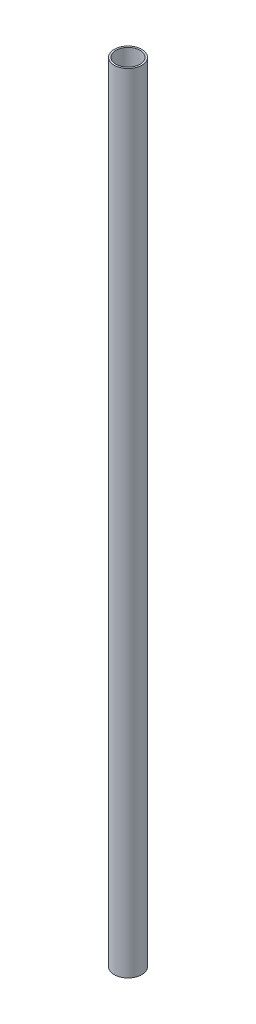
ISO-10303-21;
HEADER;
FILE_DESCRIPTION(('STEP AP214'),'2;1');
FILE_NAME('part.step','',(''),(''),'','','');
FILE_SCHEMA(('AUTOMOTIVE_DESIGN { 1 0 10303 214 1 1 1 1 }'));
ENDSEC;
DATA;
#1=APPLICATION_CONTEXT('core data for automotive mechanical design processes');
#2=APPLICATION_PROTOCOL_DEFINITION('international standard','automotive_design',2000,#1);
#3=PRODUCT_CONTEXT('',#1,'mechanical');
#4=PRODUCT('Part','Part','',(#3));
#5=PRODUCT_RELATED_PRODUCT_CATEGORY('part','',(#4));
#6=PRODUCT_DEFINITION_FORMATION('','',#4);
#7=PRODUCT_DEFINITION_CONTEXT('part definition',#1,'design');
#8=PRODUCT_DEFINITION('design','',#6,#7);
#9=PRODUCT_DEFINITION_SHAPE('','',#8);
#10=(LENGTH_UNIT() NAMED_UNIT(*) SI_UNIT(.MILLI.,.METRE.));
#11=(NAMED_UNIT(*) PLANE_ANGLE_UNIT() SI_UNIT($,.RADIAN.));
#12=(NAMED_UNIT(*) SI_UNIT($,.STERADIAN.) SOLID_ANGLE_UNIT());
#13=UNCERTAINTY_MEASURE_WITH_UNIT(LENGTH_MEASURE(1.E-05),#10,'distance_accuracy_value','');
#14=(GEOMETRIC_REPRESENTATION_CONTEXT(3) GLOBAL_UNCERTAINTY_ASSIGNED_CONTEXT((#13)) GLOBAL_UNIT_ASSIGNED_CONTEXT((#10,
#11,#12)) REPRESENTATION_CONTEXT('',''));
#15=CARTESIAN_POINT('',(0.,0.,0.));
#16=DIRECTION('',(0.,0.,1.));
#17=DIRECTION('',(1.,0.,0.));
#18=AXIS2_PLACEMENT_3D('',#15,#16,#17);
#19=CARTESIAN_POINT('',(0.,21.6725621621133,0.));
#20=DIRECTION('',(0.,1.,0.));
#21=DIRECTION('',(0.,0.,1.));
#22=AXIS2_PLACEMENT_3D('',#19,#20,#21);
#23=PLANE('',#22);
#24=CARTESIAN_POINT('',(0.,21.6725621621133,0.));
#25=DIRECTION('',(0.,1.,0.));
#26=DIRECTION('',(0.,0.,1.));
#27=AXIS2_PLACEMENT_3D('',#24,#25,#26);
#28=CIRCLE('',#27,9.52500000000004);
#29=CARTESIAN_POINT('',(0.,21.6725621621133,9.52500000000004));
#30=VERTEX_POINT('',#29);
#31=EDGE_CURVE('E10',#30,#30,#28,.T.);
#32=ORIENTED_EDGE('',*,*,#31,.T.);
#33=EDGE_LOOP('',(#32));
#34=FACE_BOUND('',#33,.T.);
#35=CARTESIAN_POINT('',(0.,21.6725621621133,0.));
#36=DIRECTION('',(0.,1.,0.));
#37=DIRECTION('',(0.,0.,1.));
#38=AXIS2_PLACEMENT_3D('',#35,#36,#37);
#39=CIRCLE('',#38,8.32500000000004);
#40=CARTESIAN_POINT('',(0.,21.6725621621133,8.32500000000004));
#41=VERTEX_POINT('',#40);
#42=EDGE_CURVE('E49',#41,#41,#39,.T.);
#43=ORIENTED_EDGE('',*,*,#42,.F.);
#44=EDGE_LOOP('',(#43));
#45=FACE_BOUND('',#44,.T.);
#46=ADVANCED_FACE('F38',(#34,#45),#23,.T.);
#47=CARTESIAN_POINT('',(0.,-521.327437837887,0.));
#48=DIRECTION('',(0.,1.,0.));
#49=DIRECTION('',(0.,0.,1.));
#50=AXIS2_PLACEMENT_3D('',#47,#48,#49);
#51=PLANE('',#50);
#52=CARTESIAN_POINT('',(0.,-521.327437837887,0.));
#53=DIRECTION('',(0.,1.,0.));
#54=DIRECTION('',(0.,0.,1.));
#55=AXIS2_PLACEMENT_3D('',#52,#53,#54);
#56=CIRCLE('',#55,9.52500000000004);
#57=CARTESIAN_POINT('',(0.,-521.327437837887,9.52500000000004));
#58=VERTEX_POINT('',#57);
#59=EDGE_CURVE('E42',#58,#58,#56,.T.);
#60=ORIENTED_EDGE('',*,*,#59,.F.);
#61=EDGE_LOOP('',(#60));
#62=FACE_BOUND('',#61,.T.);
#63=CARTESIAN_POINT('',(0.,-521.327437837887,0.));
#64=DIRECTION('',(0.,1.,0.));
#65=DIRECTION('',(0.,0.,1.));
#66=AXIS2_PLACEMENT_3D('',#63,#64,#65);
#67=CIRCLE('',#66,8.32500000000004);
#68=CARTESIAN_POINT('',(0.,-521.327437837887,8.32500000000004));
#69=VERTEX_POINT('',#68);
#70=EDGE_CURVE('E51',#69,#69,#67,.T.);
#71=ORIENTED_EDGE('',*,*,#70,.T.);
#72=EDGE_LOOP('',(#71));
#73=FACE_BOUND('',#72,.T.);
#74=ADVANCED_FACE('F61',(#62,#73),#51,.F.);
#75=CARTESIAN_POINT('',(0.,21.6725621621133,0.));
#76=DIRECTION('',(0.,-1.,0.));
#77=DIRECTION('',(0.,0.,-1.));
#78=AXIS2_PLACEMENT_3D('',#75,#76,#77);
#79=CYLINDRICAL_SURFACE('',#78,9.52500000000004);
#80=ORIENTED_EDGE('',*,*,#31,.F.);
#81=EDGE_LOOP('',(#80));
#82=FACE_BOUND('',#81,.T.);
#83=ORIENTED_EDGE('',*,*,#59,.T.);
#84=EDGE_LOOP('',(#83));
#85=FACE_BOUND('',#84,.T.);
#86=ADVANCED_FACE('F40',(#82,#85),#79,.T.);
#87=CARTESIAN_POINT('',(0.,21.6725621621133,0.));
#88=DIRECTION('',(0.,-1.,0.));
#89=DIRECTION('',(0.,0.,-1.));
#90=AXIS2_PLACEMENT_3D('',#87,#88,#89);
#91=CYLINDRICAL_SURFACE('',#90,8.32500000000004);
#92=ORIENTED_EDGE('',*,*,#42,.T.);
#93=EDGE_LOOP('',(#92));
#94=FACE_BOUND('',#93,.T.);
#95=ORIENTED_EDGE('',*,*,#70,.F.);
#96=EDGE_LOOP('',(#95));
#97=FACE_BOUND('',#96,.T.);
#98=ADVANCED_FACE('F57',(#94,#97),#91,.F.);
#99=CLOSED_SHELL('',(#46,#74,#86,#98));
#100=MANIFOLD_SOLID_BREP('B2',#99);
#101=ADVANCED_BREP_SHAPE_REPRESENTATION('',(#18,#100),#14);
#102=SHAPE_DEFINITION_REPRESENTATION(#9,#101);
ENDSEC;
END-ISO-10303-21;
